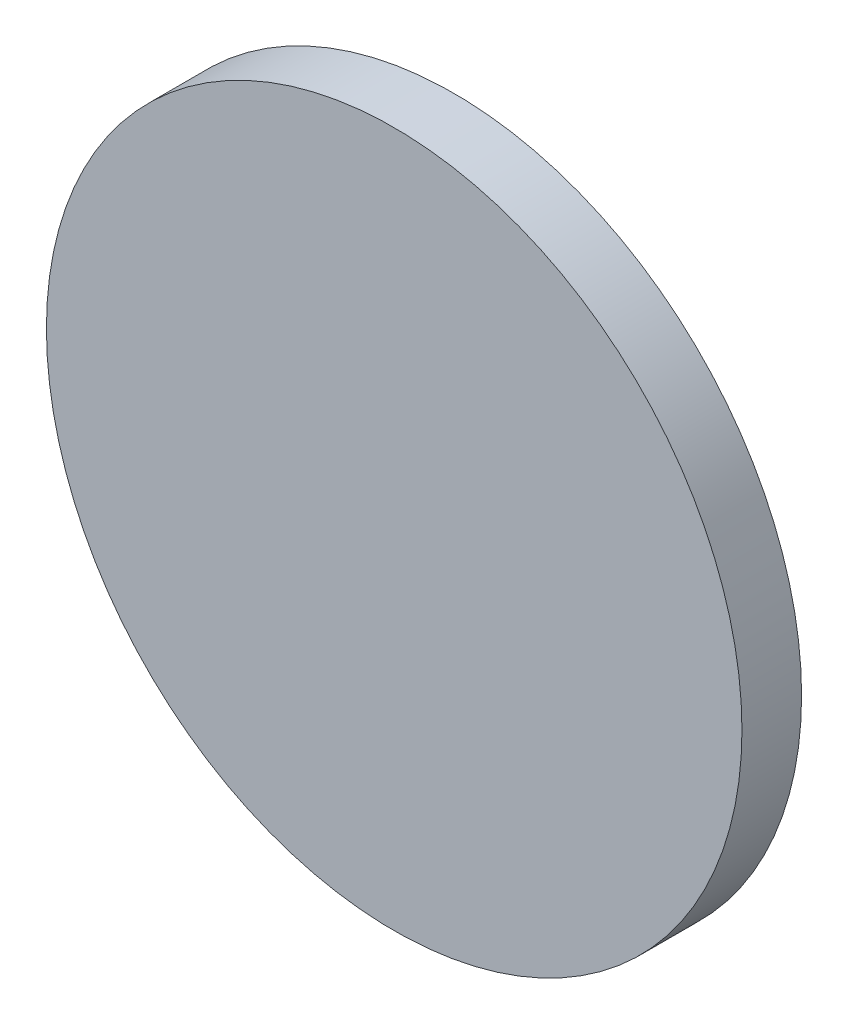
ISO-10303-21;
HEADER;
FILE_DESCRIPTION(('STEP AP214'),'2;1');
FILE_NAME('part.step','',(''),(''),'','','');
FILE_SCHEMA(('AUTOMOTIVE_DESIGN { 1 0 10303 214 1 1 1 1 }'));
ENDSEC;
DATA;
#1=APPLICATION_CONTEXT('core data for automotive mechanical design processes');
#2=APPLICATION_PROTOCOL_DEFINITION('international standard','automotive_design',2000,#1);
#3=PRODUCT_CONTEXT('',#1,'mechanical');
#4=PRODUCT('Part','Part','',(#3));
#5=PRODUCT_RELATED_PRODUCT_CATEGORY('part','',(#4));
#6=PRODUCT_DEFINITION_FORMATION('','',#4);
#7=PRODUCT_DEFINITION_CONTEXT('part definition',#1,'design');
#8=PRODUCT_DEFINITION('design','',#6,#7);
#9=PRODUCT_DEFINITION_SHAPE('','',#8);
#10=(LENGTH_UNIT() NAMED_UNIT(*) SI_UNIT(.MILLI.,.METRE.));
#11=(NAMED_UNIT(*) PLANE_ANGLE_UNIT() SI_UNIT($,.RADIAN.));
#12=(NAMED_UNIT(*) SI_UNIT($,.STERADIAN.) SOLID_ANGLE_UNIT());
#13=UNCERTAINTY_MEASURE_WITH_UNIT(LENGTH_MEASURE(1.E-05),#10,'distance_accuracy_value','');
#14=(GEOMETRIC_REPRESENTATION_CONTEXT(3) GLOBAL_UNCERTAINTY_ASSIGNED_CONTEXT((#13)) GLOBAL_UNIT_ASSIGNED_CONTEXT((#10,
#11,#12)) REPRESENTATION_CONTEXT('',''));
#15=CARTESIAN_POINT('',(0.,0.,0.));
#16=DIRECTION('',(0.,0.,1.));
#17=DIRECTION('',(1.,0.,0.));
#18=AXIS2_PLACEMENT_3D('',#15,#16,#17);
#19=CARTESIAN_POINT('',(1.30008,10.900000006176,0.));
#20=DIRECTION('',(0.,0.,-1.));
#21=DIRECTION('',(-1.,0.,0.));
#22=AXIS2_PLACEMENT_3D('',#19,#20,#21);
#23=PLANE('',#22);
#24=CARTESIAN_POINT('',(1.30008,10.900000006176,0.));
#25=DIRECTION('',(0.,0.,1.));
#26=DIRECTION('',(1.,0.,0.));
#27=AXIS2_PLACEMENT_3D('',#24,#25,#26);
#28=CIRCLE('',#27,0.200024667);
#29=CARTESIAN_POINT('',(1.500104667,10.900000006176,0.));
#30=VERTEX_POINT('',#29);
#31=EDGE_CURVE('E18',#30,#30,#28,.T.);
#32=ORIENTED_EDGE('',*,*,#31,.F.);
#33=EDGE_LOOP('',(#32));
#34=FACE_BOUND('',#33,.T.);
#35=ADVANCED_FACE('F15',(#34),#23,.T.);
#36=CARTESIAN_POINT('',(1.30008,10.900000006176,0.));
#37=DIRECTION('',(0.,0.,1.));
#38=DIRECTION('',(1.,0.,0.));
#39=AXIS2_PLACEMENT_3D('',#36,#37,#38);
#40=CYLINDRICAL_SURFACE('',#39,0.200024667);
#41=CARTESIAN_POINT('',(1.30008,10.900000006176,0.03429));
#42=DIRECTION('',(0.,0.,1.));
#43=DIRECTION('',(1.,0.,0.));
#44=AXIS2_PLACEMENT_3D('',#41,#42,#43);
#45=CIRCLE('',#44,0.200024667);
#46=CARTESIAN_POINT('',(1.500104667,10.900000006176,0.03429));
#47=VERTEX_POINT('',#46);
#48=EDGE_CURVE('E10',#47,#47,#45,.T.);
#49=ORIENTED_EDGE('',*,*,#48,.F.);
#50=EDGE_LOOP('',(#49));
#51=FACE_BOUND('',#50,.T.);
#52=ORIENTED_EDGE('',*,*,#31,.T.);
#53=EDGE_LOOP('',(#52));
#54=FACE_BOUND('',#53,.T.);
#55=ADVANCED_FACE('F27',(#51,#54),#40,.T.);
#56=CARTESIAN_POINT('',(1.30008,10.900000006176,0.03429));
#57=DIRECTION('',(0.,0.,1.));
#58=DIRECTION('',(1.,0.,0.));
#59=AXIS2_PLACEMENT_3D('',#56,#57,#58);
#60=PLANE('',#59);
#61=ORIENTED_EDGE('',*,*,#48,.T.);
#62=EDGE_LOOP('',(#61));
#63=FACE_BOUND('',#62,.T.);
#64=ADVANCED_FACE('F34',(#63),#60,.T.);
#65=CLOSED_SHELL('',(#35,#55,#64));
#66=MANIFOLD_SOLID_BREP('B1',#65);
#67=ADVANCED_BREP_SHAPE_REPRESENTATION('',(#18,#66),#14);
#68=SHAPE_DEFINITION_REPRESENTATION(#9,#67);
ENDSEC;
END-ISO-10303-21;
